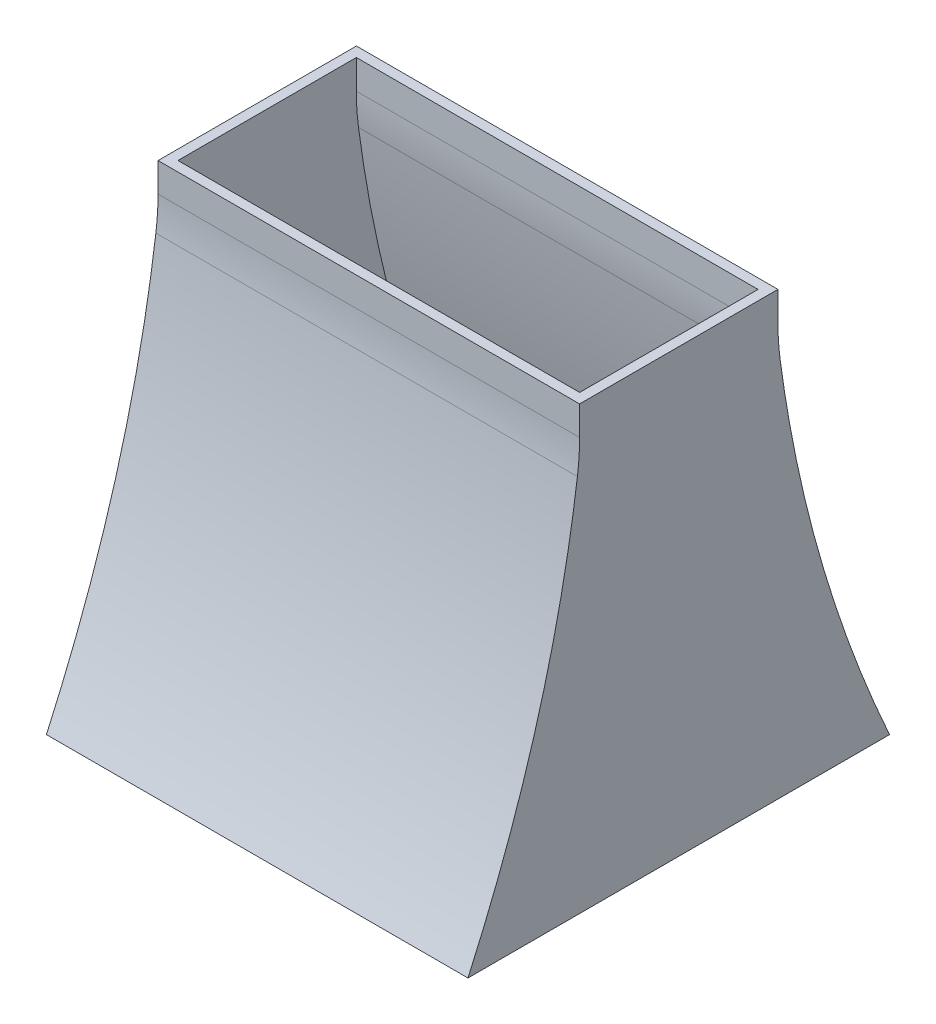
ISO-10303-21;
HEADER;
FILE_DESCRIPTION(('STEP AP214'),'2;1');
FILE_NAME('part.step','',(''),(''),'','','');
FILE_SCHEMA(('AUTOMOTIVE_DESIGN { 1 0 10303 214 1 1 1 1 }'));
ENDSEC;
DATA;
#1=APPLICATION_CONTEXT('core data for automotive mechanical design processes');
#2=APPLICATION_PROTOCOL_DEFINITION('international standard','automotive_design',2000,#1);
#3=PRODUCT_CONTEXT('',#1,'mechanical');
#4=PRODUCT('Part','Part','',(#3));
#5=PRODUCT_RELATED_PRODUCT_CATEGORY('part','',(#4));
#6=PRODUCT_DEFINITION_FORMATION('','',#4);
#7=PRODUCT_DEFINITION_CONTEXT('part definition',#1,'design');
#8=PRODUCT_DEFINITION('design','',#6,#7);
#9=PRODUCT_DEFINITION_SHAPE('','',#8);
#10=(LENGTH_UNIT() NAMED_UNIT(*) SI_UNIT(.MILLI.,.METRE.));
#11=(NAMED_UNIT(*) PLANE_ANGLE_UNIT() SI_UNIT($,.RADIAN.));
#12=(NAMED_UNIT(*) SI_UNIT($,.STERADIAN.) SOLID_ANGLE_UNIT());
#13=UNCERTAINTY_MEASURE_WITH_UNIT(LENGTH_MEASURE(1.E-05),#10,'distance_accuracy_value','');
#14=(GEOMETRIC_REPRESENTATION_CONTEXT(3) GLOBAL_UNCERTAINTY_ASSIGNED_CONTEXT((#13)) GLOBAL_UNIT_ASSIGNED_CONTEXT((#10,
#11,#12)) REPRESENTATION_CONTEXT('',''));
#15=CARTESIAN_POINT('',(0.,0.,0.));
#16=DIRECTION('',(0.,0.,1.));
#17=DIRECTION('',(1.,0.,0.));
#18=AXIS2_PLACEMENT_3D('',#15,#16,#17);
#19=CARTESIAN_POINT('',(-42.5,0.,-42.5));
#20=DIRECTION('',(-1.,0.,0.));
#21=DIRECTION('',(0.,0.,1.));
#22=AXIS2_PLACEMENT_3D('',#19,#20,#21);
#23=PLANE('',#22);
#24=DIRECTION('',(0.,0.,1.));
#25=VECTOR('',#24,1.);
#26=CARTESIAN_POINT('',(-42.5,0.,0.));
#27=LINE('',#26,#25);
#28=CARTESIAN_POINT('',(-42.5,0.,-42.5));
#29=VERTEX_POINT('',#28);
#30=CARTESIAN_POINT('',(-42.5,0.,42.5));
#31=VERTEX_POINT('',#30);
#32=EDGE_CURVE('E561',#29,#31,#27,.T.);
#33=ORIENTED_EDGE('',*,*,#32,.T.);
#34=CARTESIAN_POINT('',(-42.5,210210.252907036,977965.604386926));
#35=CARTESIAN_POINT('',(-42.5,-187378.174219566,-982253.235531481));
#36=CARTESIAN_POINT('',(-42.5,164793.0638381,986632.20472171));
#37=B_SPLINE_CURVE_WITH_KNOTS('',2,(#34,#35,#36),.UNSPECIFIED.,.F.,.F.,(3,3),(0.,1.),.UNSPECIFIED.);
#38=CARTESIAN_POINT('',(-42.5,76.539365553427,20.4385395035357));
#39=VERTEX_POINT('',#38);
#40=EDGE_CURVE('E576',#31,#39,#37,.F.);
#41=ORIENTED_EDGE('',*,*,#40,.T.);
#42=CARTESIAN_POINT('',(-42.5,83.1470605717868,69.9999999999734));
#43=DIRECTION('',(-1.,0.,0.));
#44=DIRECTION('',(0.,0.,1.));
#45=AXIS2_PLACEMENT_3D('',#42,#43,#44);
#46=CIRCLE('',#45,50.);
#47=CARTESIAN_POINT('',(-42.5,83.1470605717868,20.));
#48=VERTEX_POINT('',#47);
#49=EDGE_CURVE('E520',#39,#48,#46,.F.);
#50=ORIENTED_EDGE('',*,*,#49,.T.);
#51=DIRECTION('',(0.,-1.,0.));
#52=VECTOR('',#51,1.);
#53=CARTESIAN_POINT('',(-42.5,89.,20.));
#54=LINE('',#53,#52);
#55=CARTESIAN_POINT('',(-42.5,89.,20.));
#56=VERTEX_POINT('',#55);
#57=EDGE_CURVE('E424',#56,#48,#54,.T.);
#58=ORIENTED_EDGE('',*,*,#57,.F.);
#59=DIRECTION('',(0.,0.,1.));
#60=VECTOR('',#59,1.);
#61=CARTESIAN_POINT('',(-42.5,89.,-20.));
#62=LINE('',#61,#60);
#63=CARTESIAN_POINT('',(-42.5,89.,-20.));
#64=VERTEX_POINT('',#63);
#65=EDGE_CURVE('E417',#64,#56,#62,.T.);
#66=ORIENTED_EDGE('',*,*,#65,.F.);
#67=DIRECTION('',(0.,-1.,0.));
#68=VECTOR('',#67,1.);
#69=CARTESIAN_POINT('',(-42.5,89.,-20.));
#70=LINE('',#69,#68);
#71=CARTESIAN_POINT('',(-42.5,83.1470605743617,-20.));
#72=VERTEX_POINT('',#71);
#73=EDGE_CURVE('E427',#64,#72,#70,.T.);
#74=ORIENTED_EDGE('',*,*,#73,.T.);
#75=CARTESIAN_POINT('',(-42.5,83.1470605743617,-69.9999999998496));
#76=DIRECTION('',(-1.,0.,0.));
#77=DIRECTION('',(0.,0.,1.));
#78=AXIS2_PLACEMENT_3D('',#75,#76,#77);
#79=CIRCLE('',#78,50.);
#80=CARTESIAN_POINT('',(-42.5,76.5393655566386,-20.4385395032848));
#81=VERTEX_POINT('',#80);
#82=EDGE_CURVE('E273',#72,#81,#79,.F.);
#83=ORIENTED_EDGE('',*,*,#82,.T.);
#84=CARTESIAN_POINT('',(-42.5,164793.063838098,-986632.20472171));
#85=CARTESIAN_POINT('',(-42.5,-187378.174219563,982253.235531481));
#86=CARTESIAN_POINT('',(-42.5,210210.25290703,-977965.604386928));
#87=B_SPLINE_CURVE_WITH_KNOTS('',2,(#84,#85,#86),.UNSPECIFIED.,.F.,.F.,(3,3),(0.,1.),.UNSPECIFIED.);
#88=EDGE_CURVE('E583',#81,#29,#87,.F.);
#89=ORIENTED_EDGE('',*,*,#88,.T.);
#90=EDGE_LOOP('',(#33,#41,#50,#58,#66,#74,#83,#89));
#91=FACE_BOUND('',#90,.T.);
#92=ADVANCED_FACE('F265',(#91),#23,.T.);
#93=CARTESIAN_POINT('',(42.5,0.,42.5));
#94=DIRECTION('',(1.,0.,0.));
#95=DIRECTION('',(0.,0.,-1.));
#96=AXIS2_PLACEMENT_3D('',#93,#94,#95);
#97=PLANE('',#96);
#98=DIRECTION('',(0.,0.,-1.));
#99=VECTOR('',#98,1.);
#100=CARTESIAN_POINT('',(42.5,0.,0.));
#101=LINE('',#100,#99);
#102=CARTESIAN_POINT('',(42.5,0.,42.5));
#103=VERTEX_POINT('',#102);
#104=CARTESIAN_POINT('',(42.5,0.,-42.5));
#105=VERTEX_POINT('',#104);
#106=EDGE_CURVE('E554',#103,#105,#101,.T.);
#107=ORIENTED_EDGE('',*,*,#106,.T.);
#108=CARTESIAN_POINT('',(42.5,0.,-42.5));
#109=CARTESIAN_POINT('',(42.5,25.8652051006606,-30.7999526840193));
#110=CARTESIAN_POINT('',(42.5,52.5318717673272,-23.2999526840194));
#111=CARTESIAN_POINT('',(42.5,80.,-20.));
#112=B_SPLINE_CURVE_WITH_KNOTS('',3,(#108,#109,#110,#111),.UNSPECIFIED.,.F.,.F.,(4,4),(0.,1.),.UNSPECIFIED.);
#113=CARTESIAN_POINT('',(42.5,76.5393655566261,-20.438539503141));
#114=VERTEX_POINT('',#113);
#115=EDGE_CURVE('E558',#105,#114,#112,.T.);
#116=ORIENTED_EDGE('',*,*,#115,.T.);
#117=CARTESIAN_POINT('',(42.5,83.1470605743617,-69.9999999998496));
#118=DIRECTION('',(1.,0.,0.));
#119=DIRECTION('',(0.,0.,-1.));
#120=AXIS2_PLACEMENT_3D('',#117,#118,#119);
#121=CIRCLE('',#120,50.);
#122=CARTESIAN_POINT('',(42.5,83.1470605743617,-19.9999999997075));
#123=VERTEX_POINT('',#122);
#124=EDGE_CURVE('E13',#114,#123,#121,.F.);
#125=ORIENTED_EDGE('',*,*,#124,.T.);
#126=DIRECTION('',(0.,-1.,0.));
#127=VECTOR('',#126,1.);
#128=CARTESIAN_POINT('',(42.5,89.,-19.9999999997075));
#129=LINE('',#128,#127);
#130=CARTESIAN_POINT('',(42.5,89.,-19.9999999997075));
#131=VERTEX_POINT('',#130);
#132=EDGE_CURVE('E429',#131,#123,#129,.T.);
#133=ORIENTED_EDGE('',*,*,#132,.F.);
#134=DIRECTION('',(0.,0.,-1.));
#135=VECTOR('',#134,1.);
#136=CARTESIAN_POINT('',(42.5,89.,20.));
#137=LINE('',#136,#135);
#138=CARTESIAN_POINT('',(42.5,89.,20.));
#139=VERTEX_POINT('',#138);
#140=EDGE_CURVE('E396',#139,#131,#137,.T.);
#141=ORIENTED_EDGE('',*,*,#140,.F.);
#142=DIRECTION('',(0.,-1.,0.));
#143=VECTOR('',#142,1.);
#144=CARTESIAN_POINT('',(42.5,89.,20.));
#145=LINE('',#144,#143);
#146=CARTESIAN_POINT('',(42.5,83.1470605717868,20.));
#147=VERTEX_POINT('',#146);
#148=EDGE_CURVE('E421',#139,#147,#145,.T.);
#149=ORIENTED_EDGE('',*,*,#148,.T.);
#150=CARTESIAN_POINT('',(42.5,83.1470605717868,69.9999999999734));
#151=DIRECTION('',(1.,0.,0.));
#152=DIRECTION('',(0.,0.,-1.));
#153=AXIS2_PLACEMENT_3D('',#150,#151,#152);
#154=CIRCLE('',#153,50.);
#155=CARTESIAN_POINT('',(42.5,76.5393655534329,20.4385395035667));
#156=VERTEX_POINT('',#155);
#157=EDGE_CURVE('E526',#147,#156,#154,.F.);
#158=ORIENTED_EDGE('',*,*,#157,.T.);
#159=CARTESIAN_POINT('',(42.5,0.,42.5));
#160=CARTESIAN_POINT('',(42.5,25.8652051006605,30.7999526840193));
#161=CARTESIAN_POINT('',(42.5,52.5318717673272,23.2999526840193));
#162=CARTESIAN_POINT('',(42.5,80.,20.));
#163=B_SPLINE_CURVE_WITH_KNOTS('',3,(#159,#160,#161,#162),.UNSPECIFIED.,.F.,.F.,(4,4),(0.,1.),.UNSPECIFIED.);
#164=EDGE_CURVE('E557',#103,#156,#163,.T.);
#165=ORIENTED_EDGE('',*,*,#164,.F.);
#166=EDGE_LOOP('',(#107,#116,#125,#133,#141,#149,#158,#165));
#167=FACE_BOUND('',#166,.T.);
#168=ADVANCED_FACE('F495',(#167),#97,.T.);
#169=CARTESIAN_POINT('',(0.,0.,0.));
#170=DIRECTION('',(0.,1.,0.));
#171=DIRECTION('',(0.,0.,1.));
#172=AXIS2_PLACEMENT_3D('',#169,#170,#171);
#173=PLANE('',#172);
#174=DIRECTION('',(1.,0.,0.));
#175=VECTOR('',#174,1.);
#176=CARTESIAN_POINT('',(-40.5,2.14194981196236E-12,40.3064313994877));
#177=LINE('',#176,#175);
#178=CARTESIAN_POINT('',(-40.5,2.14194981196236E-12,40.3064313994877));
#179=VERTEX_POINT('',#178);
#180=CARTESIAN_POINT('',(40.5,2.14194981196236E-12,40.3064313994877));
#181=VERTEX_POINT('',#180);
#182=EDGE_CURVE('E478',#179,#181,#177,.T.);
#183=ORIENTED_EDGE('',*,*,#182,.T.);
#184=DIRECTION('',(0.,0.,-1.));
#185=VECTOR('',#184,1.);
#186=CARTESIAN_POINT('',(40.5,0.,0.));
#187=LINE('',#186,#185);
#188=CARTESIAN_POINT('',(40.5,-7.36986426747022E-12,-40.306431399581));
#189=VERTEX_POINT('',#188);
#190=EDGE_CURVE('E479',#181,#189,#187,.T.);
#191=ORIENTED_EDGE('',*,*,#190,.T.);
#192=DIRECTION('',(1.,0.,0.));
#193=VECTOR('',#192,1.);
#194=CARTESIAN_POINT('',(40.5,-7.36986426747022E-12,-40.306431399581));
#195=LINE('',#194,#193);
#196=CARTESIAN_POINT('',(-40.5,-7.36986426747022E-12,-40.306431399581));
#197=VERTEX_POINT('',#196);
#198=EDGE_CURVE('E590',#189,#197,#195,.F.);
#199=ORIENTED_EDGE('',*,*,#198,.T.);
#200=DIRECTION('',(0.,0.,1.));
#201=VECTOR('',#200,1.);
#202=CARTESIAN_POINT('',(-40.5,0.,0.));
#203=LINE('',#202,#201);
#204=EDGE_CURVE('E484',#197,#179,#203,.T.);
#205=ORIENTED_EDGE('',*,*,#204,.T.);
#206=EDGE_LOOP('',(#183,#191,#199,#205));
#207=FACE_BOUND('',#206,.T.);
#208=ORIENTED_EDGE('',*,*,#106,.F.);
#209=DIRECTION('',(1.,0.,0.));
#210=VECTOR('',#209,1.);
#211=CARTESIAN_POINT('',(0.,0.,42.5));
#212=LINE('',#211,#210);
#213=EDGE_CURVE('E559',#31,#103,#212,.T.);
#214=ORIENTED_EDGE('',*,*,#213,.F.);
#215=ORIENTED_EDGE('',*,*,#32,.F.);
#216=DIRECTION('',(-1.,0.,0.));
#217=VECTOR('',#216,1.);
#218=CARTESIAN_POINT('',(0.,0.,-42.5));
#219=LINE('',#218,#217);
#220=EDGE_CURVE('E553',#105,#29,#219,.T.);
#221=ORIENTED_EDGE('',*,*,#220,.F.);
#222=EDGE_LOOP('',(#208,#214,#215,#221));
#223=FACE_BOUND('',#222,.T.);
#224=ADVANCED_FACE('F491',(#207,#223),#173,.F.);
#225=CARTESIAN_POINT('',(-48.5,164793.063838098,-986632.20472171));
#226=CARTESIAN_POINT('',(-48.5,-187378.174219563,982253.235531481));
#227=CARTESIAN_POINT('',(-48.5,210210.25290703,-977965.604386928));
#228=B_SPLINE_CURVE_WITH_KNOTS('',2,(#225,#226,#227),.UNSPECIFIED.,.F.,.F.,(3,3),(0.,1.),.UNSPECIFIED.);
#229=DIRECTION('',(1.,0.,0.));
#230=VECTOR('',#229,1.);
#231=SURFACE_OF_LINEAR_EXTRUSION('',#228,#230);
#232=ORIENTED_EDGE('',*,*,#88,.F.);
#233=DIRECTION('',(1.,0.,0.));
#234=VECTOR('',#233,1.);
#235=CARTESIAN_POINT('',(-42.5,76.5393655566453,-20.4385395032847));
#236=LINE('',#235,#234);
#237=EDGE_CURVE('E286',#81,#114,#236,.T.);
#238=ORIENTED_EDGE('',*,*,#237,.T.);
#239=ORIENTED_EDGE('',*,*,#115,.F.);
#240=ORIENTED_EDGE('',*,*,#220,.T.);
#241=EDGE_LOOP('',(#232,#238,#239,#240));
#242=FACE_BOUND('',#241,.T.);
#243=ADVANCED_FACE('F450',(#242),#231,.T.);
#244=CARTESIAN_POINT('',(-48.5,210210.252907036,977965.604386926));
#245=CARTESIAN_POINT('',(-48.5,-187378.174219566,-982253.235531481));
#246=CARTESIAN_POINT('',(-48.5,164793.0638381,986632.20472171));
#247=B_SPLINE_CURVE_WITH_KNOTS('',2,(#244,#245,#246),.UNSPECIFIED.,.F.,.F.,(3,3),(0.,1.),.UNSPECIFIED.);
#248=DIRECTION('',(1.,0.,0.));
#249=VECTOR('',#248,1.);
#250=SURFACE_OF_LINEAR_EXTRUSION('',#247,#249);
#251=ORIENTED_EDGE('',*,*,#164,.T.);
#252=DIRECTION('',(1.,0.,0.));
#253=VECTOR('',#252,1.);
#254=CARTESIAN_POINT('',(42.5,76.5393655534288,20.4385395035354));
#255=LINE('',#254,#253);
#256=EDGE_CURVE('E521',#156,#39,#255,.F.);
#257=ORIENTED_EDGE('',*,*,#256,.T.);
#258=ORIENTED_EDGE('',*,*,#40,.F.);
#259=ORIENTED_EDGE('',*,*,#213,.T.);
#260=EDGE_LOOP('',(#251,#257,#258,#259));
#261=FACE_BOUND('',#260,.T.);
#262=ADVANCED_FACE('F445',(#261),#250,.T.);
#263=CARTESIAN_POINT('',(-40.5,0.,-42.5));
#264=DIRECTION('',(-1.,0.,0.));
#265=DIRECTION('',(0.,0.,1.));
#266=AXIS2_PLACEMENT_3D('',#263,#264,#265);
#267=PLANE('',#266);
#268=ORIENTED_EDGE('',*,*,#204,.F.);
#269=CARTESIAN_POINT('',(-40.5,80.0000000000017,-17.9857258904085));
#270=CARTESIAN_POINT('',(-40.5,77.6865290692571,-18.2615525793809));
#271=CARTESIAN_POINT('',(-40.5,75.3766148691131,-18.5672483817526));
#272=CARTESIAN_POINT('',(-40.5,70.7729586731254,-19.2372203489555));
#273=CARTESIAN_POINT('',(-40.5,68.4791885190254,-19.6013030516712));
#274=CARTESIAN_POINT('',(-40.5,63.9077473400121,-20.3876665865526));
#275=CARTESIAN_POINT('',(-40.5,61.6300500298667,-20.8097945936448));
#276=CARTESIAN_POINT('',(-40.5,57.0906778306972,-21.7118260272646));
#277=CARTESIAN_POINT('',(-40.5,54.8289805546936,-22.1916168018921));
#278=CARTESIAN_POINT('',(-40.5,50.3215306059441,-23.2085651149098));
#279=CARTESIAN_POINT('',(-40.5,48.0757613721297,-23.7456492571307));
#280=CARTESIAN_POINT('',(-40.5,43.6000879916183,-24.8767755049243));
#281=CARTESIAN_POINT('',(-40.5,41.3701749198281,-25.4707823013658));
#282=CARTESIAN_POINT('',(-40.5,36.9264514299674,-26.7152598655907));
#283=CARTESIAN_POINT('',(-40.5,34.7126391191998,-27.3657238764512));
#284=CARTESIAN_POINT('',(-40.5,30.3006559391579,-28.7228044689709));
#285=CARTESIAN_POINT('',(-40.5,28.102496676991,-29.4294587772741));
#286=CARTESIAN_POINT('',(-40.5,23.7216849286224,-30.8985443659908));
#287=CARTESIAN_POINT('',(-40.5,21.5390566421133,-31.6610477893189));
#288=CARTESIAN_POINT('',(-40.5,17.1891713658441,-33.241463278435));
#289=CARTESIAN_POINT('',(-40.5,15.0219523445098,-34.0594798210365));
#290=CARTESIAN_POINT('',(-40.5,10.7027585715674,-35.7505674377626));
#291=CARTESIAN_POINT('',(-40.5,8.55083654918703,-36.6237731247424));
#292=CARTESIAN_POINT('',(-40.5,4.2620841550218,-38.4248728595367));
#293=CARTESIAN_POINT('',(-40.5,2.12532196438632,-39.3529292894932));
#294=CARTESIAN_POINT('',(-40.5,-9.17983137421752E-12,-40.3064313995828));
#295=B_SPLINE_CURVE_WITH_KNOTS('',3,(#269,#270,#271,#272,#273,#274,#275,#276,#277,#278,#279,
#280,#281,#282,#283,#284,#285,#286,#287,#288,#289,#290,#291,#292,#293,#294),.UNSPECIFIED.,.F.,
.F.,(4,2,2,2,2,2,2,2,2,2,2,2,4),(0.,6.98937980506387,13.956061778967,20.9047406747415,
27.8400585748354,34.7665962607834,41.6888648883323,48.6103061830187,55.5364344806152,
62.4716729697534,69.4203464916499,76.3866767243852,83.3747779296613),.UNSPECIFIED.);
#296=CARTESIAN_POINT('',(-40.5,76.5690322307696,-18.4170514439352));
#297=VERTEX_POINT('',#296);
#298=EDGE_CURVE('E432',#297,#197,#295,.T.);
#299=ORIENTED_EDGE('',*,*,#298,.F.);
#300=CARTESIAN_POINT('',(-40.5,83.1223911877017,-67.9857258904201));
#301=DIRECTION('',(-1.,0.,0.));
#302=DIRECTION('',(0.,0.,1.));
#303=AXIS2_PLACEMENT_3D('',#300,#301,#302);
#304=CIRCLE('',#303,50.);
#305=CARTESIAN_POINT('',(-40.5,83.1223911877017,-17.9857258904085));
#306=VERTEX_POINT('',#305);
#307=EDGE_CURVE('E536',#297,#306,#304,.T.);
#308=ORIENTED_EDGE('',*,*,#307,.T.);
#309=DIRECTION('',(0.,-1.,0.));
#310=VECTOR('',#309,1.);
#311=CARTESIAN_POINT('',(-40.5,89.,-17.9857258904085));
#312=LINE('',#311,#310);
#313=CARTESIAN_POINT('',(-40.5,89.,-17.9857258904085));
#314=VERTEX_POINT('',#313);
#315=EDGE_CURVE('E384',#314,#306,#312,.T.);
#316=ORIENTED_EDGE('',*,*,#315,.F.);
#317=DIRECTION('',(0.,0.,1.));
#318=VECTOR('',#317,1.);
#319=CARTESIAN_POINT('',(-40.5,89.,-17.9857258904085));
#320=LINE('',#319,#318);
#321=CARTESIAN_POINT('',(-40.5,89.,17.9857258902176));
#322=VERTEX_POINT('',#321);
#323=EDGE_CURVE('E377',#314,#322,#320,.T.);
#324=ORIENTED_EDGE('',*,*,#323,.T.);
#325=DIRECTION('',(0.,-1.,0.));
#326=VECTOR('',#325,1.);
#327=CARTESIAN_POINT('',(-40.5,89.,17.9857258902176));
#328=LINE('',#327,#326);
#329=CARTESIAN_POINT('',(-40.5,83.1223911876136,17.9857258902176));
#330=VERTEX_POINT('',#329);
#331=EDGE_CURVE('E381',#322,#330,#328,.T.);
#332=ORIENTED_EDGE('',*,*,#331,.T.);
#333=CARTESIAN_POINT('',(-40.5,83.1223911876136,67.9857258902562));
#334=DIRECTION('',(-1.,0.,0.));
#335=DIRECTION('',(0.,0.,1.));
#336=AXIS2_PLACEMENT_3D('',#333,#334,#335);
#337=CIRCLE('',#336,50.);
#338=CARTESIAN_POINT('',(-40.5,76.5690322305964,18.4170514437545));
#339=VERTEX_POINT('',#338);
#340=EDGE_CURVE('E528',#330,#339,#337,.T.);
#341=ORIENTED_EDGE('',*,*,#340,.T.);
#342=CARTESIAN_POINT('',(-40.5,2.14194981196236E-12,40.3064313994877));
#343=CARTESIAN_POINT('',(-40.5,2.12532196442047,39.3529292894554));
#344=CARTESIAN_POINT('',(-40.5,4.26208415505024,38.424872859484));
#345=CARTESIAN_POINT('',(-40.5,8.55083654919457,36.6237731246334));
#346=CARTESIAN_POINT('',(-40.5,10.7027585715597,35.7505674376124));
#347=CARTESIAN_POINT('',(-40.5,15.0219523445062,34.0594798208958));
#348=CARTESIAN_POINT('',(-40.5,17.1891713658596,33.2414632783446));
#349=CARTESIAN_POINT('',(-40.5,21.5390566421316,31.6610477892317));
#350=CARTESIAN_POINT('',(-40.5,23.7216849286244,30.8985443658567));
#351=CARTESIAN_POINT('',(-40.5,28.1024966769893,29.4294587771287));
#352=CARTESIAN_POINT('',(-40.5,30.3006559391687,28.7228044688609));
#353=CARTESIAN_POINT('',(-40.5,34.7126391192122,27.3657238763399));
#354=CARTESIAN_POINT('',(-40.5,36.9264514299691,26.7152598654425));
#355=CARTESIAN_POINT('',(-40.5,41.3701749198316,25.4707823012322));
#356=CARTESIAN_POINT('',(-40.5,43.6000879916345,24.8767755048421));
#357=CARTESIAN_POINT('',(-40.5,48.0757613721456,23.7456492570414));
#358=CARTESIAN_POINT('',(-40.5,50.3215306059472,23.2085651147622));
#359=CARTESIAN_POINT('',(-40.5,54.8289805546871,22.1916168016962));
#360=CARTESIAN_POINT('',(-40.5,57.0906778306941,21.7118260270788));
#361=CARTESIAN_POINT('',(-40.5,61.6300500298711,20.8097945934921));
#362=CARTESIAN_POINT('',(-40.5,63.9077473400208,20.3876665864228));
#363=CARTESIAN_POINT('',(-40.5,68.4791885190303,19.6013030515168));
#364=CARTESIAN_POINT('',(-40.5,70.7729586731221,19.2372203487532));
#365=CARTESIAN_POINT('',(-40.5,75.3766148691018,18.5672483814959));
#366=CARTESIAN_POINT('',(-40.5,77.6865290692461,18.261552579118));
#367=CARTESIAN_POINT('',(-40.5,80.0000000000029,17.9857258902175));
#368=B_SPLINE_CURVE_WITH_KNOTS('',3,(#342,#343,#344,#345,#346,#347,#348,#349,#350,#351,#352,
#353,#354,#355,#356,#357,#358,#359,#360,#361,#362,#363,#364,#365,#366,#367),.UNSPECIFIED.,.F.,
.F.,(4,2,2,2,2,2,2,2,2,2,2,2,4),(0.,6.98810120527599,13.9544314380149,20.9031049599118,
27.8383434490508,34.76447174665,41.6859130413363,48.6081816688824,55.5347193548348,
62.4700372549299,69.4187161507061,76.3853981246075,83.3747779296757),.UNSPECIFIED.);
#369=EDGE_CURVE('E465',#179,#339,#368,.T.);
#370=ORIENTED_EDGE('',*,*,#369,.F.);
#371=EDGE_LOOP('',(#268,#299,#308,#316,#324,#332,#341,#370));
#372=FACE_BOUND('',#371,.T.);
#373=ADVANCED_FACE('F380',(#372),#267,.F.);
#374=CARTESIAN_POINT('',(40.5,0.,42.5));
#375=DIRECTION('',(1.,0.,0.));
#376=DIRECTION('',(0.,0.,-1.));
#377=AXIS2_PLACEMENT_3D('',#374,#375,#376);
#378=PLANE('',#377);
#379=ORIENTED_EDGE('',*,*,#190,.F.);
#380=CARTESIAN_POINT('',(40.5,2.14194981196236E-12,40.3064313994877));
#381=CARTESIAN_POINT('',(40.5,2.12532196442047,39.3529292894554));
#382=CARTESIAN_POINT('',(40.5,4.26208415505024,38.424872859484));
#383=CARTESIAN_POINT('',(40.5,8.55083654919457,36.6237731246334));
#384=CARTESIAN_POINT('',(40.5,10.7027585715597,35.7505674376124));
#385=CARTESIAN_POINT('',(40.5,15.0219523445062,34.0594798208958));
#386=CARTESIAN_POINT('',(40.5,17.1891713658596,33.2414632783446));
#387=CARTESIAN_POINT('',(40.5,21.5390566421316,31.6610477892317));
#388=CARTESIAN_POINT('',(40.5,23.7216849286244,30.8985443658567));
#389=CARTESIAN_POINT('',(40.5,28.1024966769893,29.4294587771287));
#390=CARTESIAN_POINT('',(40.5,30.3006559391687,28.7228044688609));
#391=CARTESIAN_POINT('',(40.5,34.7126391192122,27.3657238763399));
#392=CARTESIAN_POINT('',(40.5,36.9264514299691,26.7152598654425));
#393=CARTESIAN_POINT('',(40.5,41.3701749198316,25.4707823012322));
#394=CARTESIAN_POINT('',(40.5,43.6000879916345,24.8767755048421));
#395=CARTESIAN_POINT('',(40.5,48.0757613721456,23.7456492570414));
#396=CARTESIAN_POINT('',(40.5,50.3215306059472,23.2085651147622));
#397=CARTESIAN_POINT('',(40.5,54.8289805546871,22.1916168016962));
#398=CARTESIAN_POINT('',(40.5,57.0906778306941,21.7118260270788));
#399=CARTESIAN_POINT('',(40.5,61.6300500298711,20.8097945934921));
#400=CARTESIAN_POINT('',(40.5,63.9077473400208,20.3876665864228));
#401=CARTESIAN_POINT('',(40.5,68.4791885190303,19.6013030515168));
#402=CARTESIAN_POINT('',(40.5,70.7729586731221,19.2372203487532));
#403=CARTESIAN_POINT('',(40.5,75.3766148691018,18.5672483814959));
#404=CARTESIAN_POINT('',(40.5,77.6865290692461,18.261552579118));
#405=CARTESIAN_POINT('',(40.5,80.0000000000029,17.9857258902175));
#406=B_SPLINE_CURVE_WITH_KNOTS('',3,(#380,#381,#382,#383,#384,#385,#386,#387,#388,#389,#390,
#391,#392,#393,#394,#395,#396,#397,#398,#399,#400,#401,#402,#403,#404,#405),.UNSPECIFIED.,.F.,
.F.,(4,2,2,2,2,2,2,2,2,2,2,2,4),(0.,6.98810120527599,13.9544314380149,20.9031049599118,
27.8383434490508,34.76447174665,41.6859130413363,48.6081816688824,55.5347193548348,
62.4700372549299,69.4187161507061,76.3853981246075,83.3747779296757),.UNSPECIFIED.);
#407=CARTESIAN_POINT('',(40.5,76.5690322305919,18.4170514437833));
#408=VERTEX_POINT('',#407);
#409=EDGE_CURVE('E471',#181,#408,#406,.T.);
#410=ORIENTED_EDGE('',*,*,#409,.T.);
#411=CARTESIAN_POINT('',(40.5,83.1223911876136,67.9857258902562));
#412=DIRECTION('',(1.,0.,0.));
#413=DIRECTION('',(0.,0.,-1.));
#414=AXIS2_PLACEMENT_3D('',#411,#412,#413);
#415=CIRCLE('',#414,50.);
#416=CARTESIAN_POINT('',(40.5,83.1223911876136,17.9857258902176));
#417=VERTEX_POINT('',#416);
#418=EDGE_CURVE('E532',#408,#417,#415,.T.);
#419=ORIENTED_EDGE('',*,*,#418,.T.);
#420=DIRECTION('',(0.,-1.,0.));
#421=VECTOR('',#420,1.);
#422=CARTESIAN_POINT('',(40.5,89.,17.9857258902176));
#423=LINE('',#422,#421);
#424=CARTESIAN_POINT('',(40.5,89.,17.9857258902176));
#425=VERTEX_POINT('',#424);
#426=EDGE_CURVE('E397',#425,#417,#423,.T.);
#427=ORIENTED_EDGE('',*,*,#426,.F.);
#428=DIRECTION('',(0.,0.,-1.));
#429=VECTOR('',#428,1.);
#430=CARTESIAN_POINT('',(40.5,89.,17.9857258902176));
#431=LINE('',#430,#429);
#432=CARTESIAN_POINT('',(40.5,89.,-17.9857258904085));
#433=VERTEX_POINT('',#432);
#434=EDGE_CURVE('E402',#425,#433,#431,.T.);
#435=ORIENTED_EDGE('',*,*,#434,.T.);
#436=DIRECTION('',(0.,-1.,0.));
#437=VECTOR('',#436,1.);
#438=CARTESIAN_POINT('',(40.5,89.,-17.9857258904085));
#439=LINE('',#438,#437);
#440=CARTESIAN_POINT('',(40.5,83.1223911877017,-17.9857258904085));
#441=VERTEX_POINT('',#440);
#442=EDGE_CURVE('E409',#433,#441,#439,.T.);
#443=ORIENTED_EDGE('',*,*,#442,.T.);
#444=CARTESIAN_POINT('',(40.5,83.1223911877017,-67.9857258904201));
#445=DIRECTION('',(1.,0.,0.));
#446=DIRECTION('',(0.,0.,-1.));
#447=AXIS2_PLACEMENT_3D('',#444,#445,#446);
#448=CIRCLE('',#447,50.);
#449=CARTESIAN_POINT('',(40.5,76.5690322307696,-18.4170514439352));
#450=VERTEX_POINT('',#449);
#451=EDGE_CURVE('E534',#441,#450,#448,.T.);
#452=ORIENTED_EDGE('',*,*,#451,.T.);
#453=CARTESIAN_POINT('',(40.5,-7.36986426747022E-12,-40.306431399581));
#454=CARTESIAN_POINT('',(40.5,2.12532196438627,-39.3529292894871));
#455=CARTESIAN_POINT('',(40.5,4.26208415502083,-38.4248728595282));
#456=CARTESIAN_POINT('',(40.5,8.55083654918602,-36.6237731247339));
#457=CARTESIAN_POINT('',(40.5,10.7027585715672,-35.7505674377565));
#458=CARTESIAN_POINT('',(40.5,15.0219523445136,-34.0594798210412));
#459=CARTESIAN_POINT('',(40.5,17.1891713658508,-33.2414632784479));
#460=CARTESIAN_POINT('',(40.5,21.5390566421249,-31.6610477893459));
#461=CARTESIAN_POINT('',(40.5,23.7216849286359,-30.8985443660238));
#462=CARTESIAN_POINT('',(40.5,28.1024966770016,-29.4294587772994));
#463=CARTESIAN_POINT('',(40.5,30.3006559391635,-28.7228044689826));
#464=CARTESIAN_POINT('',(40.5,34.7126391191998,-27.3657238764466));
#465=CARTESIAN_POINT('',(40.5,36.9264514299668,-26.7152598655835));
#466=CARTESIAN_POINT('',(40.5,41.3701749198305,-25.4707823013725));
#467=CARTESIAN_POINT('',(40.5,43.6000879916243,-24.8767755049475));
#468=CARTESIAN_POINT('',(40.5,48.0757613721357,-23.7456492571541));
#469=CARTESIAN_POINT('',(40.5,50.3215306059464,-23.2085651149171));
#470=CARTESIAN_POINT('',(40.5,54.8289805546931,-22.1916168018876));
#471=CARTESIAN_POINT('',(40.5,57.0906778306978,-21.7118260272647));
#472=CARTESIAN_POINT('',(40.5,61.6300500298673,-20.8097945936445));
#473=CARTESIAN_POINT('',(40.5,63.9077473400118,-20.3876665865473));
#474=CARTESIAN_POINT('',(40.5,68.4791885190269,-19.6013030516762));
#475=CARTESIAN_POINT('',(40.5,70.7729586731295,-19.2372203489758));
#476=CARTESIAN_POINT('',(40.5,75.376614869119,-18.5672483817856));
#477=CARTESIAN_POINT('',(40.5,77.6865290692622,-18.2615525794115));
#478=CARTESIAN_POINT('',(40.5,80.0000000000017,-17.9857258904085));
#479=B_SPLINE_CURVE_WITH_KNOTS('',3,(#453,#454,#455,#456,#457,#458,#459,#460,#461,#462,#463,
#464,#465,#466,#467,#468,#469,#470,#471,#472,#473,#474,#475,#476,#477,#478),.UNSPECIFIED.,.F.,
.F.,(4,2,2,2,2,2,2,2,2,2,2,2,4),(0.,6.98810120527639,13.9544314380112,20.9031049599072,
27.8383434490453,34.7644717466406,41.6859130413266,48.6081816688737,55.5347193548224,
62.4700372549162,69.4187161506904,76.3853981245944,83.3747779296563),.UNSPECIFIED.);
#480=EDGE_CURVE('E480',#189,#450,#479,.T.);
#481=ORIENTED_EDGE('',*,*,#480,.F.);
#482=EDGE_LOOP('',(#379,#410,#419,#427,#435,#443,#452,#481));
#483=FACE_BOUND('',#482,.T.);
#484=ADVANCED_FACE('F486',(#483),#378,.F.);
#485=CARTESIAN_POINT('',(-48.5,164793.063838098,-986632.20472171));
#486=CARTESIAN_POINT('',(-48.5,-187378.174219563,982253.235531481));
#487=CARTESIAN_POINT('',(-48.5,210210.25290703,-977965.604386928));
#488=B_SPLINE_CURVE_WITH_KNOTS('',2,(#485,#486,#487),.UNSPECIFIED.,.F.,.F.,(3,3),(0.,1.),.UNSPECIFIED.);
#489=DIRECTION('',(1.,0.,0.));
#490=VECTOR('',#489,1.);
#491=SURFACE_OF_LINEAR_EXTRUSION('',#488,#490);
#492=OFFSET_SURFACE('',#491,-2.,.F.);
#493=ORIENTED_EDGE('',*,*,#480,.T.);
#494=DIRECTION('',(1.,0.,0.));
#495=VECTOR('',#494,1.);
#496=CARTESIAN_POINT('',(40.5,76.5690322307724,-18.4170514439349));
#497=LINE('',#496,#495);
#498=EDGE_CURVE('E550',#450,#297,#497,.F.);
#499=ORIENTED_EDGE('',*,*,#498,.T.);
#500=ORIENTED_EDGE('',*,*,#298,.T.);
#501=ORIENTED_EDGE('',*,*,#198,.F.);
#502=EDGE_LOOP('',(#493,#499,#500,#501));
#503=FACE_BOUND('',#502,.T.);
#504=ADVANCED_FACE('F460',(#503),#492,.F.);
#505=CARTESIAN_POINT('',(-48.5,210210.252907036,977965.604386926));
#506=CARTESIAN_POINT('',(-48.5,-187378.174219566,-982253.235531481));
#507=CARTESIAN_POINT('',(-48.5,164793.0638381,986632.20472171));
#508=B_SPLINE_CURVE_WITH_KNOTS('',2,(#505,#506,#507),.UNSPECIFIED.,.F.,.F.,(3,3),(0.,1.),.UNSPECIFIED.);
#509=DIRECTION('',(1.,0.,0.));
#510=VECTOR('',#509,1.);
#511=SURFACE_OF_LINEAR_EXTRUSION('',#508,#510);
#512=OFFSET_SURFACE('',#511,-2.,.F.);
#513=ORIENTED_EDGE('',*,*,#369,.T.);
#514=DIRECTION('',(1.,0.,0.));
#515=VECTOR('',#514,1.);
#516=CARTESIAN_POINT('',(-40.5,76.5690322305928,18.4170514437833));
#517=LINE('',#516,#515);
#518=EDGE_CURVE('E545',#339,#408,#517,.T.);
#519=ORIENTED_EDGE('',*,*,#518,.T.);
#520=ORIENTED_EDGE('',*,*,#409,.F.);
#521=ORIENTED_EDGE('',*,*,#182,.F.);
#522=EDGE_LOOP('',(#513,#519,#520,#521));
#523=FACE_BOUND('',#522,.T.);
#524=ADVANCED_FACE('F456',(#523),#512,.F.);
#525=CARTESIAN_POINT('',(0.,89.,0.));
#526=DIRECTION('',(0.,1.,0.));
#527=DIRECTION('',(0.,0.,1.));
#528=AXIS2_PLACEMENT_3D('',#525,#526,#527);
#529=PLANE('',#528);
#530=ORIENTED_EDGE('',*,*,#140,.T.);
#531=DIRECTION('',(-1.,0.,-3.44148729122316E-12));
#532=VECTOR('',#531,1.);
#533=CARTESIAN_POINT('',(42.5,89.,-19.9999999997075));
#534=LINE('',#533,#532);
#535=EDGE_CURVE('E415',#131,#64,#534,.T.);
#536=ORIENTED_EDGE('',*,*,#535,.T.);
#537=ORIENTED_EDGE('',*,*,#65,.T.);
#538=DIRECTION('',(1.,0.,0.));
#539=VECTOR('',#538,1.);
#540=CARTESIAN_POINT('',(-42.5,89.,20.));
#541=LINE('',#540,#539);
#542=EDGE_CURVE('E419',#56,#139,#541,.T.);
#543=ORIENTED_EDGE('',*,*,#542,.T.);
#544=EDGE_LOOP('',(#530,#536,#537,#543));
#545=FACE_BOUND('',#544,.T.);
#546=DIRECTION('',(1.,0.,0.));
#547=VECTOR('',#546,1.);
#548=CARTESIAN_POINT('',(-40.5,89.,17.9857258902176));
#549=LINE('',#548,#547);
#550=EDGE_CURVE('E388',#322,#425,#549,.T.);
#551=ORIENTED_EDGE('',*,*,#550,.F.);
#552=ORIENTED_EDGE('',*,*,#323,.F.);
#553=DIRECTION('',(-1.,0.,0.));
#554=VECTOR('',#553,1.);
#555=CARTESIAN_POINT('',(40.5,89.,-17.9857258904085));
#556=LINE('',#555,#554);
#557=EDGE_CURVE('E404',#433,#314,#556,.T.);
#558=ORIENTED_EDGE('',*,*,#557,.F.);
#559=ORIENTED_EDGE('',*,*,#434,.F.);
#560=EDGE_LOOP('',(#551,#552,#558,#559));
#561=FACE_BOUND('',#560,.T.);
#562=ADVANCED_FACE('F400',(#545,#561),#529,.T.);
#563=CARTESIAN_POINT('',(42.5,89.,-19.9999999997075));
#564=DIRECTION('',(-3.44148729122316E-12,0.,1.));
#565=DIRECTION('',(1.,0.,3.44148729122316E-12));
#566=AXIS2_PLACEMENT_3D('',#563,#564,#565);
#567=PLANE('',#566);
#568=ORIENTED_EDGE('',*,*,#132,.T.);
#569=DIRECTION('',(1.,0.,3.44148729122316E-12));
#570=VECTOR('',#569,1.);
#571=CARTESIAN_POINT('',(42.5,83.1470605743617,-19.9999999997075));
#572=LINE('',#571,#570);
#573=EDGE_CURVE('E539',#123,#72,#572,.F.);
#574=ORIENTED_EDGE('',*,*,#573,.T.);
#575=ORIENTED_EDGE('',*,*,#73,.F.);
#576=ORIENTED_EDGE('',*,*,#535,.F.);
#577=EDGE_LOOP('',(#568,#574,#575,#576));
#578=FACE_BOUND('',#577,.T.);
#579=ADVANCED_FACE('F625',(#578),#567,.F.);
#580=CARTESIAN_POINT('',(-42.5,89.,20.));
#581=DIRECTION('',(0.,0.,-1.));
#582=DIRECTION('',(-1.,0.,0.));
#583=AXIS2_PLACEMENT_3D('',#580,#581,#582);
#584=PLANE('',#583);
#585=ORIENTED_EDGE('',*,*,#57,.T.);
#586=DIRECTION('',(1.,0.,0.));
#587=VECTOR('',#586,1.);
#588=CARTESIAN_POINT('',(-42.5,83.1470605717868,20.));
#589=LINE('',#588,#587);
#590=EDGE_CURVE('E523',#48,#147,#589,.T.);
#591=ORIENTED_EDGE('',*,*,#590,.T.);
#592=ORIENTED_EDGE('',*,*,#148,.F.);
#593=ORIENTED_EDGE('',*,*,#542,.F.);
#594=EDGE_LOOP('',(#585,#591,#592,#593));
#595=FACE_BOUND('',#594,.T.);
#596=ADVANCED_FACE('F620',(#595),#584,.F.);
#597=CARTESIAN_POINT('',(-40.5,89.,17.9857258902176));
#598=DIRECTION('',(0.,0.,-1.));
#599=DIRECTION('',(-1.,0.,0.));
#600=AXIS2_PLACEMENT_3D('',#597,#598,#599);
#601=PLANE('',#600);
#602=ORIENTED_EDGE('',*,*,#426,.T.);
#603=DIRECTION('',(-1.,0.,0.));
#604=VECTOR('',#603,1.);
#605=CARTESIAN_POINT('',(-40.5,83.1223911876136,17.9857258902176));
#606=LINE('',#605,#604);
#607=EDGE_CURVE('E395',#417,#330,#606,.T.);
#608=ORIENTED_EDGE('',*,*,#607,.T.);
#609=ORIENTED_EDGE('',*,*,#331,.F.);
#610=ORIENTED_EDGE('',*,*,#550,.T.);
#611=EDGE_LOOP('',(#602,#608,#609,#610));
#612=FACE_BOUND('',#611,.T.);
#613=ADVANCED_FACE('F392',(#612),#601,.T.);
#614=CARTESIAN_POINT('',(40.5,89.,-17.9857258904085));
#615=DIRECTION('',(0.,0.,1.));
#616=DIRECTION('',(1.,0.,0.));
#617=AXIS2_PLACEMENT_3D('',#614,#615,#616);
#618=PLANE('',#617);
#619=ORIENTED_EDGE('',*,*,#315,.T.);
#620=DIRECTION('',(-1.,0.,0.));
#621=VECTOR('',#620,1.);
#622=CARTESIAN_POINT('',(40.5,83.1223911877017,-17.9857258904085));
#623=LINE('',#622,#621);
#624=EDGE_CURVE('E548',#306,#441,#623,.F.);
#625=ORIENTED_EDGE('',*,*,#624,.T.);
#626=ORIENTED_EDGE('',*,*,#442,.F.);
#627=ORIENTED_EDGE('',*,*,#557,.T.);
#628=EDGE_LOOP('',(#619,#625,#626,#627));
#629=FACE_BOUND('',#628,.T.);
#630=ADVANCED_FACE('F506',(#629),#618,.T.);
#631=CARTESIAN_POINT('',(0.,83.1223911877017,-67.9857258904201));
#632=DIRECTION('',(1.,0.,0.));
#633=DIRECTION('',(0.,0.,-1.));
#634=AXIS2_PLACEMENT_3D('',#631,#632,#633);
#635=CYLINDRICAL_SURFACE('',#634,50.);
#636=ORIENTED_EDGE('',*,*,#451,.F.);
#637=ORIENTED_EDGE('',*,*,#624,.F.);
#638=ORIENTED_EDGE('',*,*,#307,.F.);
#639=ORIENTED_EDGE('',*,*,#498,.F.);
#640=EDGE_LOOP('',(#636,#637,#638,#639));
#641=FACE_BOUND('',#640,.T.);
#642=ADVANCED_FACE('F502',(#641),#635,.T.);
#643=CARTESIAN_POINT('',(0.,83.1223911876136,67.9857258902562));
#644=DIRECTION('',(1.,0.,0.));
#645=DIRECTION('',(0.,0.,-1.));
#646=AXIS2_PLACEMENT_3D('',#643,#644,#645);
#647=CYLINDRICAL_SURFACE('',#646,50.);
#648=ORIENTED_EDGE('',*,*,#340,.F.);
#649=ORIENTED_EDGE('',*,*,#607,.F.);
#650=ORIENTED_EDGE('',*,*,#418,.F.);
#651=ORIENTED_EDGE('',*,*,#518,.F.);
#652=EDGE_LOOP('',(#648,#649,#650,#651));
#653=FACE_BOUND('',#652,.T.);
#654=ADVANCED_FACE('F505',(#653),#647,.T.);
#655=CARTESIAN_POINT('',(0.,83.1470605717868,69.9999999999734));
#656=DIRECTION('',(1.,0.,0.));
#657=DIRECTION('',(0.,0.,-1.));
#658=AXIS2_PLACEMENT_3D('',#655,#656,#657);
#659=CYLINDRICAL_SURFACE('',#658,50.);
#660=ORIENTED_EDGE('',*,*,#49,.F.);
#661=ORIENTED_EDGE('',*,*,#256,.F.);
#662=ORIENTED_EDGE('',*,*,#157,.F.);
#663=ORIENTED_EDGE('',*,*,#590,.F.);
#664=EDGE_LOOP('',(#660,#661,#662,#663));
#665=FACE_BOUND('',#664,.T.);
#666=ADVANCED_FACE('F509',(#665),#659,.F.);
#667=CARTESIAN_POINT('',(8.06646416329143E-11,83.1470605743617,-69.9999999998496));
#668=DIRECTION('',(1.,0.,0.));
#669=DIRECTION('',(0.,0.,-1.));
#670=AXIS2_PLACEMENT_3D('',#667,#668,#669);
#671=CYLINDRICAL_SURFACE('',#670,50.);
#672=ORIENTED_EDGE('',*,*,#124,.F.);
#673=ORIENTED_EDGE('',*,*,#237,.F.);
#674=ORIENTED_EDGE('',*,*,#82,.F.);
#675=ORIENTED_EDGE('',*,*,#573,.F.);
#676=EDGE_LOOP('',(#672,#673,#674,#675));
#677=FACE_BOUND('',#676,.T.);
#678=ADVANCED_FACE('F267',(#677),#671,.F.);
#679=CLOSED_SHELL('',(#92,#168,#224,#243,#262,#373,#484,#504,#524,#562,#579,#596,#613,#630,#642,
#654,#666,#678));
#680=MANIFOLD_SOLID_BREP('B2',#679);
#681=ADVANCED_BREP_SHAPE_REPRESENTATION('',(#18,#680),#14);
#682=SHAPE_DEFINITION_REPRESENTATION(#9,#681);
ENDSEC;
END-ISO-10303-21;
